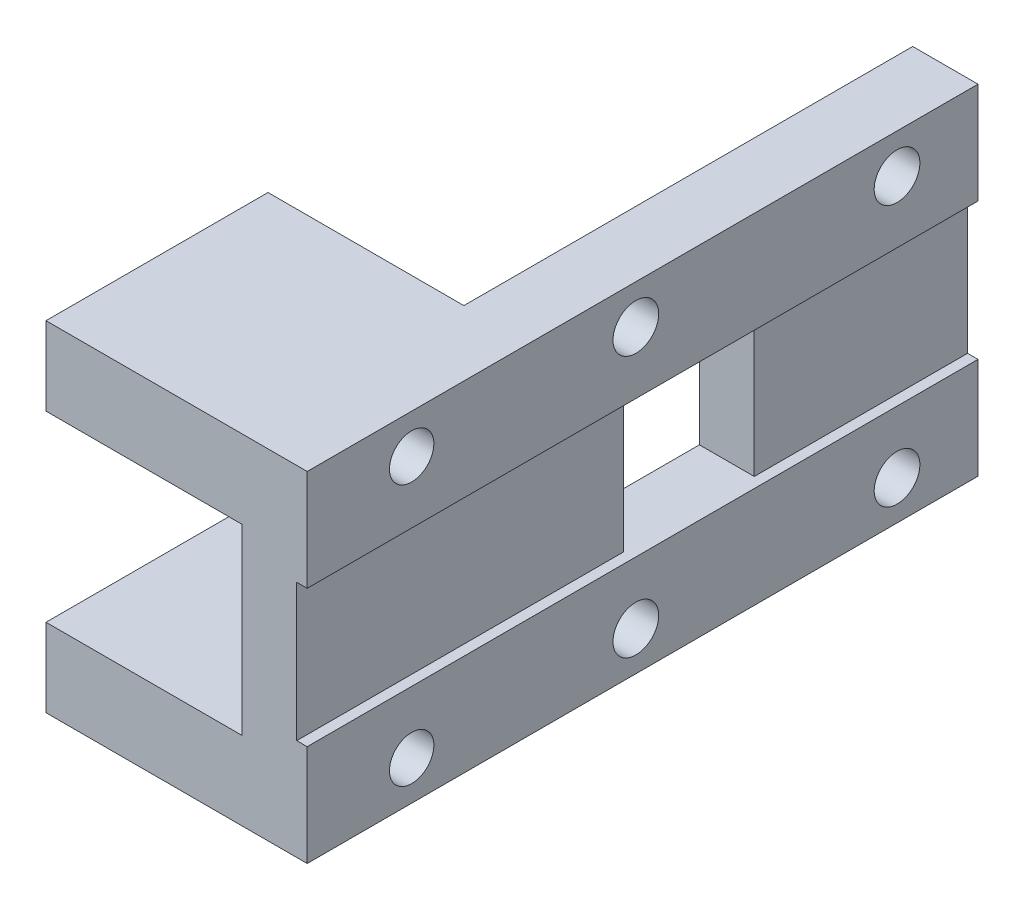
ISO-10303-21;
HEADER;
FILE_DESCRIPTION(('STEP AP214'),'2;1');
FILE_NAME('part.step','',(''),(''),'','','');
FILE_SCHEMA(('AUTOMOTIVE_DESIGN { 1 0 10303 214 1 1 1 1 }'));
ENDSEC;
DATA;
#1=APPLICATION_CONTEXT('core data for automotive mechanical design processes');
#2=APPLICATION_PROTOCOL_DEFINITION('international standard','automotive_design',2000,#1);
#3=PRODUCT_CONTEXT('',#1,'mechanical');
#4=PRODUCT('Part','Part','',(#3));
#5=PRODUCT_RELATED_PRODUCT_CATEGORY('part','',(#4));
#6=PRODUCT_DEFINITION_FORMATION('','',#4);
#7=PRODUCT_DEFINITION_CONTEXT('part definition',#1,'design');
#8=PRODUCT_DEFINITION('design','',#6,#7);
#9=PRODUCT_DEFINITION_SHAPE('','',#8);
#10=(LENGTH_UNIT() NAMED_UNIT(*) SI_UNIT(.MILLI.,.METRE.));
#11=(NAMED_UNIT(*) PLANE_ANGLE_UNIT() SI_UNIT($,.RADIAN.));
#12=(NAMED_UNIT(*) SI_UNIT($,.STERADIAN.) SOLID_ANGLE_UNIT());
#13=UNCERTAINTY_MEASURE_WITH_UNIT(LENGTH_MEASURE(1.E-05),#10,'distance_accuracy_value','');
#14=(GEOMETRIC_REPRESENTATION_CONTEXT(3) GLOBAL_UNCERTAINTY_ASSIGNED_CONTEXT((#13)) GLOBAL_UNIT_ASSIGNED_CONTEXT((#10,
#11,#12)) REPRESENTATION_CONTEXT('',''));
#15=CARTESIAN_POINT('',(0.,0.,0.));
#16=DIRECTION('',(0.,0.,1.));
#17=DIRECTION('',(1.,0.,0.));
#18=AXIS2_PLACEMENT_3D('',#15,#16,#17);
#19=CARTESIAN_POINT('',(136.99996276809,-124.000037425625,-132.46692088768));
#20=DIRECTION('',(0.,-1.,0.));
#21=DIRECTION('',(-1.,0.,0.));
#22=AXIS2_PLACEMENT_3D('',#19,#20,#21);
#23=PLANE('',#22);
#24=DIRECTION('',(0.,0.,1.));
#25=VECTOR('',#24,1.);
#26=CARTESIAN_POINT('',(136.99996276809,-124.000037425625,-132.46692088768));
#27=LINE('',#26,#25);
#28=CARTESIAN_POINT('',(136.99996276809,-124.000037425625,-132.46692088768));
#29=VERTEX_POINT('',#28);
#30=CARTESIAN_POINT('',(136.99996276809,-124.000037425625,-97.3000017784545));
#31=VERTEX_POINT('',#30);
#32=EDGE_CURVE('E295',#29,#31,#27,.T.);
#33=ORIENTED_EDGE('',*,*,#32,.T.);
#34=DIRECTION('',(1.,0.,0.));
#35=VECTOR('',#34,1.);
#36=CARTESIAN_POINT('',(131.99996276809,-124.000037425625,-97.3000017784545));
#37=LINE('',#36,#35);
#38=CARTESIAN_POINT('',(116.99996276809,-124.000037425625,-97.3000017784545));
#39=VERTEX_POINT('',#38);
#40=EDGE_CURVE('E450',#39,#31,#37,.T.);
#41=ORIENTED_EDGE('',*,*,#40,.F.);
#42=DIRECTION('',(0.,0.,1.));
#43=VECTOR('',#42,1.);
#44=CARTESIAN_POINT('',(116.99996276809,-124.000037425625,-114.300001778454));
#45=LINE('',#44,#43);
#46=CARTESIAN_POINT('',(116.99996276809,-124.000037425625,-114.300001778454));
#47=VERTEX_POINT('',#46);
#48=EDGE_CURVE('E369',#47,#39,#45,.T.);
#49=ORIENTED_EDGE('',*,*,#48,.F.);
#50=DIRECTION('',(-1.,0.,0.));
#51=VECTOR('',#50,1.);
#52=CARTESIAN_POINT('',(131.99996276809,-124.000037425625,-114.300001778454));
#53=LINE('',#52,#51);
#54=CARTESIAN_POINT('',(131.99996276809,-124.000037425625,-114.300001778454));
#55=VERTEX_POINT('',#54);
#56=EDGE_CURVE('E340',#55,#47,#53,.T.);
#57=ORIENTED_EDGE('',*,*,#56,.F.);
#58=DIRECTION('',(0.,0.,1.));
#59=VECTOR('',#58,1.);
#60=CARTESIAN_POINT('',(131.99996276809,-124.000037425625,-132.46692088768));
#61=LINE('',#60,#59);
#62=CARTESIAN_POINT('',(131.99996276809,-124.000037425625,-132.46692088768));
#63=VERTEX_POINT('',#62);
#64=EDGE_CURVE('E287',#63,#55,#61,.T.);
#65=ORIENTED_EDGE('',*,*,#64,.F.);
#66=DIRECTION('',(0.,0.,-1.));
#67=VECTOR('',#66,1.);
#68=CARTESIAN_POINT('',(131.99996276809,-124.000037425625,-132.46692088768));
#69=LINE('',#68,#67);
#70=CARTESIAN_POINT('',(131.99996276809,-124.000037425625,-148.66692088768));
#71=VERTEX_POINT('',#70);
#72=EDGE_CURVE('E284',#63,#71,#69,.T.);
#73=ORIENTED_EDGE('',*,*,#72,.T.);
#74=DIRECTION('',(-1.,0.,0.));
#75=VECTOR('',#74,1.);
#76=CARTESIAN_POINT('',(136.99996276809,-124.000037425625,-148.66692088768));
#77=LINE('',#76,#75);
#78=CARTESIAN_POINT('',(136.99996276809,-124.000037425625,-148.66692088768));
#79=VERTEX_POINT('',#78);
#80=EDGE_CURVE('E296',#71,#79,#77,.F.);
#81=ORIENTED_EDGE('',*,*,#80,.T.);
#82=DIRECTION('',(0.,0.,-1.));
#83=VECTOR('',#82,1.);
#84=CARTESIAN_POINT('',(136.99996276809,-124.000037425625,-132.46692088768));
#85=LINE('',#84,#83);
#86=EDGE_CURVE('E292',#79,#29,#85,.F.);
#87=ORIENTED_EDGE('',*,*,#86,.T.);
#88=EDGE_LOOP('',(#33,#41,#49,#57,#65,#73,#81,#87));
#89=FACE_BOUND('',#88,.T.);
#90=ADVANCED_FACE('F16',(#89),#23,.T.);
#91=CARTESIAN_POINT('',(136.99996276809,-98.0000370381948,-106.000001778454));
#92=DIRECTION('',(0.,1.,0.));
#93=DIRECTION('',(1.,0.,0.));
#94=AXIS2_PLACEMENT_3D('',#91,#92,#93);
#95=PLANE('',#94);
#96=DIRECTION('',(0.,0.,1.));
#97=VECTOR('',#96,1.);
#98=CARTESIAN_POINT('',(136.99996276809,-98.0000370381948,-106.000001778454));
#99=LINE('',#98,#97);
#100=CARTESIAN_POINT('',(136.99996276809,-98.0000370381948,-132.46692088768));
#101=VERTEX_POINT('',#100);
#102=CARTESIAN_POINT('',(136.99996276809,-98.0000370381948,-97.3000017784545));
#103=VERTEX_POINT('',#102);
#104=EDGE_CURVE('E240',#101,#103,#99,.T.);
#105=ORIENTED_EDGE('',*,*,#104,.F.);
#106=DIRECTION('',(0.,0.,-1.));
#107=VECTOR('',#106,1.);
#108=CARTESIAN_POINT('',(136.99996276809,-98.0000370381948,-106.000001778454));
#109=LINE('',#108,#107);
#110=CARTESIAN_POINT('',(136.99996276809,-98.0000370381948,-148.66692088768));
#111=VERTEX_POINT('',#110);
#112=EDGE_CURVE('E20',#101,#111,#109,.T.);
#113=ORIENTED_EDGE('',*,*,#112,.T.);
#114=DIRECTION('',(1.,0.,0.));
#115=VECTOR('',#114,1.);
#116=CARTESIAN_POINT('',(136.99996276809,-98.0000370381948,-148.66692088768));
#117=LINE('',#116,#115);
#118=CARTESIAN_POINT('',(131.99996276809,-98.0000370381948,-148.66692088768));
#119=VERTEX_POINT('',#118);
#120=EDGE_CURVE('E248',#111,#119,#117,.F.);
#121=ORIENTED_EDGE('',*,*,#120,.T.);
#122=DIRECTION('',(0.,0.,-1.));
#123=VECTOR('',#122,1.);
#124=CARTESIAN_POINT('',(131.99996276809,-98.0000370381948,-106.000001778454));
#125=LINE('',#124,#123);
#126=CARTESIAN_POINT('',(131.99996276809,-98.0000370381948,-132.46692088768));
#127=VERTEX_POINT('',#126);
#128=EDGE_CURVE('E288',#119,#127,#125,.F.);
#129=ORIENTED_EDGE('',*,*,#128,.T.);
#130=DIRECTION('',(0.,0.,1.));
#131=VECTOR('',#130,1.);
#132=CARTESIAN_POINT('',(131.99996276809,-98.0000370381948,-106.000001778454));
#133=LINE('',#132,#131);
#134=CARTESIAN_POINT('',(131.99996276809,-98.0000370381948,-114.300001778454));
#135=VERTEX_POINT('',#134);
#136=EDGE_CURVE('E291',#127,#135,#133,.T.);
#137=ORIENTED_EDGE('',*,*,#136,.T.);
#138=DIRECTION('',(-1.,0.,0.));
#139=VECTOR('',#138,1.);
#140=CARTESIAN_POINT('',(131.99996276809,-98.0000370381948,-114.300001778454));
#141=LINE('',#140,#139);
#142=CARTESIAN_POINT('',(116.99996276809,-98.0000370381948,-114.300001778454));
#143=VERTEX_POINT('',#142);
#144=EDGE_CURVE('E372',#135,#143,#141,.T.);
#145=ORIENTED_EDGE('',*,*,#144,.T.);
#146=DIRECTION('',(0.,0.,1.));
#147=VECTOR('',#146,1.);
#148=CARTESIAN_POINT('',(116.99996276809,-98.0000370381948,-102.300001778455));
#149=LINE('',#148,#147);
#150=CARTESIAN_POINT('',(116.99996276809,-98.0000370381948,-97.3000017784545));
#151=VERTEX_POINT('',#150);
#152=EDGE_CURVE('E395',#143,#151,#149,.T.);
#153=ORIENTED_EDGE('',*,*,#152,.T.);
#154=DIRECTION('',(-1.,0.,0.));
#155=VECTOR('',#154,1.);
#156=CARTESIAN_POINT('',(136.99996276809,-98.0000370381948,-97.3000017784545));
#157=LINE('',#156,#155);
#158=EDGE_CURVE('E326',#103,#151,#157,.T.);
#159=ORIENTED_EDGE('',*,*,#158,.F.);
#160=EDGE_LOOP('',(#105,#113,#121,#129,#137,#145,#153,#159));
#161=FACE_BOUND('',#160,.T.);
#162=ADVANCED_FACE('F260',(#161),#95,.T.);
#163=CARTESIAN_POINT('',(136.99996276809,-101.00003723191,-122.46692088768));
#164=DIRECTION('',(-1.,0.,0.));
#165=DIRECTION('',(0.,-1.,0.));
#166=AXIS2_PLACEMENT_3D('',#163,#164,#165);
#167=CYLINDRICAL_SURFACE('',#166,1.75);
#168=CARTESIAN_POINT('',(131.99996276809,-101.00003723191,-122.46692088768));
#169=DIRECTION('',(1.,0.,0.));
#170=DIRECTION('',(0.,-1.,0.));
#171=AXIS2_PLACEMENT_3D('',#168,#169,#170);
#172=CIRCLE('',#171,1.75);
#173=CARTESIAN_POINT('',(131.99996276809,-99.25003723191,-122.46692088768));
#174=VERTEX_POINT('',#173);
#175=EDGE_CURVE('E380',#174,#174,#172,.T.);
#176=ORIENTED_EDGE('',*,*,#175,.F.);
#177=DIRECTION('',(1.,0.,0.));
#178=VECTOR('',#177,1.);
#179=CARTESIAN_POINT('',(136.99996276809,-99.25003723191,-122.46692088768));
#180=LINE('',#179,#178);
#181=CARTESIAN_POINT('',(136.99996276809,-99.25003723191,-122.46692088768));
#182=VERTEX_POINT('',#181);
#183=EDGE_CURVE('E11',#174,#182,#180,.T.);
#184=ORIENTED_EDGE('',*,*,#183,.T.);
#185=CARTESIAN_POINT('',(136.99996276809,-101.00003723191,-122.46692088768));
#186=DIRECTION('',(1.,0.,0.));
#187=DIRECTION('',(0.,-1.,0.));
#188=AXIS2_PLACEMENT_3D('',#185,#186,#187);
#189=CIRCLE('',#188,1.75);
#190=EDGE_CURVE('E283',#182,#182,#189,.T.);
#191=ORIENTED_EDGE('',*,*,#190,.T.);
#192=ORIENTED_EDGE('',*,*,#183,.F.);
#193=EDGE_LOOP('',(#176,#184,#191,#192));
#194=FACE_BOUND('',#193,.T.);
#195=ADVANCED_FACE('F18',(#194),#167,.F.);
#196=CARTESIAN_POINT('',(136.99996276809,-121.00003723191,-142.46692088768));
#197=DIRECTION('',(-1.,0.,0.));
#198=DIRECTION('',(0.,-1.,0.));
#199=AXIS2_PLACEMENT_3D('',#196,#197,#198);
#200=CYLINDRICAL_SURFACE('',#199,1.75);
#201=CARTESIAN_POINT('',(131.99996276809,-121.00003723191,-142.46692088768));
#202=DIRECTION('',(1.,0.,0.));
#203=DIRECTION('',(0.,-1.,0.));
#204=AXIS2_PLACEMENT_3D('',#201,#202,#203);
#205=CIRCLE('',#204,1.75);
#206=CARTESIAN_POINT('',(131.99996276809,-119.25003723191,-142.46692088768));
#207=VERTEX_POINT('',#206);
#208=EDGE_CURVE('E375',#207,#207,#205,.T.);
#209=ORIENTED_EDGE('',*,*,#208,.F.);
#210=DIRECTION('',(1.,0.,0.));
#211=VECTOR('',#210,1.);
#212=CARTESIAN_POINT('',(136.99996276809,-119.25003723191,-142.46692088768));
#213=LINE('',#212,#211);
#214=CARTESIAN_POINT('',(136.99996276809,-119.25003723191,-142.46692088768));
#215=VERTEX_POINT('',#214);
#216=EDGE_CURVE('E27',#207,#215,#213,.T.);
#217=ORIENTED_EDGE('',*,*,#216,.T.);
#218=CARTESIAN_POINT('',(136.99996276809,-121.00003723191,-142.46692088768));
#219=DIRECTION('',(1.,0.,0.));
#220=DIRECTION('',(0.,-1.,0.));
#221=AXIS2_PLACEMENT_3D('',#218,#219,#220);
#222=CIRCLE('',#221,1.75);
#223=EDGE_CURVE('E415',#215,#215,#222,.T.);
#224=ORIENTED_EDGE('',*,*,#223,.T.);
#225=ORIENTED_EDGE('',*,*,#216,.F.);
#226=EDGE_LOOP('',(#209,#217,#224,#225));
#227=FACE_BOUND('',#226,.T.);
#228=ADVANCED_FACE('F689',(#227),#200,.F.);
#229=CARTESIAN_POINT('',(136.99996276809,-121.00003723191,-122.46692088768));
#230=DIRECTION('',(-1.,0.,0.));
#231=DIRECTION('',(0.,-1.,0.));
#232=AXIS2_PLACEMENT_3D('',#229,#230,#231);
#233=CYLINDRICAL_SURFACE('',#232,1.75);
#234=CARTESIAN_POINT('',(131.99996276809,-121.00003723191,-122.46692088768));
#235=DIRECTION('',(1.,0.,0.));
#236=DIRECTION('',(0.,-1.,0.));
#237=AXIS2_PLACEMENT_3D('',#234,#235,#236);
#238=CIRCLE('',#237,1.75);
#239=CARTESIAN_POINT('',(131.99996276809,-119.25003723191,-122.46692088768));
#240=VERTEX_POINT('',#239);
#241=EDGE_CURVE('E379',#240,#240,#238,.T.);
#242=ORIENTED_EDGE('',*,*,#241,.F.);
#243=DIRECTION('',(1.,0.,0.));
#244=VECTOR('',#243,1.);
#245=CARTESIAN_POINT('',(136.99996276809,-119.25003723191,-122.46692088768));
#246=LINE('',#245,#244);
#247=CARTESIAN_POINT('',(136.99996276809,-119.25003723191,-122.46692088768));
#248=VERTEX_POINT('',#247);
#249=EDGE_CURVE('E418',#240,#248,#246,.T.);
#250=ORIENTED_EDGE('',*,*,#249,.T.);
#251=CARTESIAN_POINT('',(136.99996276809,-121.00003723191,-122.46692088768));
#252=DIRECTION('',(1.,0.,0.));
#253=DIRECTION('',(0.,-1.,0.));
#254=AXIS2_PLACEMENT_3D('',#251,#252,#253);
#255=CIRCLE('',#254,1.75);
#256=EDGE_CURVE('E294',#248,#248,#255,.T.);
#257=ORIENTED_EDGE('',*,*,#256,.T.);
#258=ORIENTED_EDGE('',*,*,#249,.F.);
#259=EDGE_LOOP('',(#242,#250,#257,#258));
#260=FACE_BOUND('',#259,.T.);
#261=ADVANCED_FACE('F694',(#260),#233,.F.);
#262=CARTESIAN_POINT('',(136.99996276809,-101.00003723191,-142.46692088768));
#263=DIRECTION('',(-1.,0.,0.));
#264=DIRECTION('',(0.,-1.,0.));
#265=AXIS2_PLACEMENT_3D('',#262,#263,#264);
#266=CYLINDRICAL_SURFACE('',#265,1.75);
#267=CARTESIAN_POINT('',(131.99996276809,-101.00003723191,-142.46692088768));
#268=DIRECTION('',(1.,0.,0.));
#269=DIRECTION('',(0.,-1.,0.));
#270=AXIS2_PLACEMENT_3D('',#267,#268,#269);
#271=CIRCLE('',#270,1.75);
#272=CARTESIAN_POINT('',(131.99996276809,-99.25003723191,-142.46692088768));
#273=VERTEX_POINT('',#272);
#274=EDGE_CURVE('E405',#273,#273,#271,.T.);
#275=ORIENTED_EDGE('',*,*,#274,.F.);
#276=DIRECTION('',(1.,0.,0.));
#277=VECTOR('',#276,1.);
#278=CARTESIAN_POINT('',(136.99996276809,-99.25003723191,-142.46692088768));
#279=LINE('',#278,#277);
#280=CARTESIAN_POINT('',(136.99996276809,-99.25003723191,-142.46692088768));
#281=VERTEX_POINT('',#280);
#282=EDGE_CURVE('E41',#273,#281,#279,.T.);
#283=ORIENTED_EDGE('',*,*,#282,.T.);
#284=CARTESIAN_POINT('',(136.99996276809,-101.00003723191,-142.46692088768));
#285=DIRECTION('',(1.,0.,0.));
#286=DIRECTION('',(0.,-1.,0.));
#287=AXIS2_PLACEMENT_3D('',#284,#285,#286);
#288=CIRCLE('',#287,1.75);
#289=EDGE_CURVE('E411',#281,#281,#288,.T.);
#290=ORIENTED_EDGE('',*,*,#289,.T.);
#291=ORIENTED_EDGE('',*,*,#282,.F.);
#292=EDGE_LOOP('',(#275,#283,#290,#291));
#293=FACE_BOUND('',#292,.T.);
#294=ADVANCED_FACE('F718',(#293),#266,.F.);
#295=CARTESIAN_POINT('',(136.19996276809,-111.00003723191,-127.333461333067));
#296=DIRECTION('',(-1.,0.,0.));
#297=DIRECTION('',(0.,0.,1.));
#298=AXIS2_PLACEMENT_3D('',#295,#296,#297);
#299=PLANE('',#298);
#300=DIRECTION('',(0.,-1.,0.));
#301=VECTOR('',#300,1.);
#302=CARTESIAN_POINT('',(136.19996276809,-108.47503723191,-132.333461333067));
#303=LINE('',#302,#301);
#304=CARTESIAN_POINT('',(136.19996276809,-105.75003723191,-132.333461333067));
#305=VERTEX_POINT('',#304);
#306=CARTESIAN_POINT('',(136.19996276809,-116.25003723191,-132.333461333067));
#307=VERTEX_POINT('',#306);
#308=EDGE_CURVE('E401',#305,#307,#303,.T.);
#309=ORIENTED_EDGE('',*,*,#308,.T.);
#310=DIRECTION('',(0.,0.,-1.));
#311=VECTOR('',#310,1.);
#312=CARTESIAN_POINT('',(136.19996276809,-116.25003723191,-148.66692088768));
#313=LINE('',#312,#311);
#314=CARTESIAN_POINT('',(136.19996276809,-116.25003723191,-148.66692088768));
#315=VERTEX_POINT('',#314);
#316=EDGE_CURVE('E351',#307,#315,#313,.T.);
#317=ORIENTED_EDGE('',*,*,#316,.T.);
#318=DIRECTION('',(0.,-1.,0.));
#319=VECTOR('',#318,1.);
#320=CARTESIAN_POINT('',(136.19996276809,-108.525046394351,-148.66692088768));
#321=LINE('',#320,#319);
#322=CARTESIAN_POINT('',(136.19996276809,-105.75003723191,-148.66692088768));
#323=VERTEX_POINT('',#322);
#324=EDGE_CURVE('E313',#323,#315,#321,.T.);
#325=ORIENTED_EDGE('',*,*,#324,.F.);
#326=DIRECTION('',(0.,0.,1.));
#327=VECTOR('',#326,1.);
#328=CARTESIAN_POINT('',(136.19996276809,-105.75003723191,-106.000001778454));
#329=LINE('',#328,#327);
#330=EDGE_CURVE('E324',#323,#305,#329,.T.);
#331=ORIENTED_EDGE('',*,*,#330,.T.);
#332=EDGE_LOOP('',(#309,#317,#325,#331));
#333=FACE_BOUND('',#332,.T.);
#334=ADVANCED_FACE('F568',(#333),#299,.F.);
#335=CARTESIAN_POINT('',(136.19996276809,-111.00003723191,-127.333461333067));
#336=DIRECTION('',(-1.,0.,0.));
#337=DIRECTION('',(0.,0.,1.));
#338=AXIS2_PLACEMENT_3D('',#335,#336,#337);
#339=PLANE('',#338);
#340=DIRECTION('',(0.,1.,0.));
#341=VECTOR('',#340,1.);
#342=CARTESIAN_POINT('',(136.19996276809,-113.52503723191,-122.333461333067));
#343=LINE('',#342,#341);
#344=CARTESIAN_POINT('',(136.19996276809,-116.25003723191,-122.333461333067));
#345=VERTEX_POINT('',#344);
#346=CARTESIAN_POINT('',(136.19996276809,-105.75003723191,-122.333461333067));
#347=VERTEX_POINT('',#346);
#348=EDGE_CURVE('E404',#345,#347,#343,.T.);
#349=ORIENTED_EDGE('',*,*,#348,.T.);
#350=DIRECTION('',(0.,0.,1.));
#351=VECTOR('',#350,1.);
#352=CARTESIAN_POINT('',(136.19996276809,-105.75003723191,-106.000001778454));
#353=LINE('',#352,#351);
#354=CARTESIAN_POINT('',(136.19996276809,-105.75003723191,-97.3000017784545));
#355=VERTEX_POINT('',#354);
#356=EDGE_CURVE('E427',#347,#355,#353,.T.);
#357=ORIENTED_EDGE('',*,*,#356,.T.);
#358=DIRECTION('',(0.,1.,0.));
#359=VECTOR('',#358,1.);
#360=CARTESIAN_POINT('',(136.19996276809,-120.025037328767,-97.3000017784545));
#361=LINE('',#360,#359);
#362=CARTESIAN_POINT('',(136.19996276809,-116.25003723191,-97.3000017784545));
#363=VERTEX_POINT('',#362);
#364=EDGE_CURVE('E352',#363,#355,#361,.T.);
#365=ORIENTED_EDGE('',*,*,#364,.F.);
#366=DIRECTION('',(0.,0.,-1.));
#367=VECTOR('',#366,1.);
#368=CARTESIAN_POINT('',(136.19996276809,-116.25003723191,-106.000001778454));
#369=LINE('',#368,#367);
#370=EDGE_CURVE('E423',#363,#345,#369,.T.);
#371=ORIENTED_EDGE('',*,*,#370,.T.);
#372=EDGE_LOOP('',(#349,#357,#365,#371));
#373=FACE_BOUND('',#372,.T.);
#374=ADVANCED_FACE('F583',(#373),#339,.F.);
#375=CARTESIAN_POINT('',(136.19996276809,-116.05003723191,-122.333461333067));
#376=DIRECTION('',(0.,0.,1.));
#377=DIRECTION('',(1.,0.,0.));
#378=AXIS2_PLACEMENT_3D('',#375,#376,#377);
#379=PLANE('',#378);
#380=DIRECTION('',(0.,-1.,0.));
#381=VECTOR('',#380,1.);
#382=CARTESIAN_POINT('',(131.99996276809,-113.52503723191,-122.333461333067));
#383=LINE('',#382,#381);
#384=CARTESIAN_POINT('',(131.99996276809,-105.75003723191,-122.333461333067));
#385=VERTEX_POINT('',#384);
#386=CARTESIAN_POINT('',(131.99996276809,-116.25003723191,-122.333461333067));
#387=VERTEX_POINT('',#386);
#388=EDGE_CURVE('E342',#385,#387,#383,.T.);
#389=ORIENTED_EDGE('',*,*,#388,.F.);
#390=DIRECTION('',(1.,0.,0.));
#391=VECTOR('',#390,1.);
#392=CARTESIAN_POINT('',(136.19996276809,-105.75003723191,-122.333461333067));
#393=LINE('',#392,#391);
#394=EDGE_CURVE('E431',#385,#347,#393,.T.);
#395=ORIENTED_EDGE('',*,*,#394,.T.);
#396=ORIENTED_EDGE('',*,*,#348,.F.);
#397=DIRECTION('',(-1.,0.,0.));
#398=VECTOR('',#397,1.);
#399=CARTESIAN_POINT('',(136.19996276809,-116.25003723191,-122.333461333067));
#400=LINE('',#399,#398);
#401=EDGE_CURVE('E419',#345,#387,#400,.T.);
#402=ORIENTED_EDGE('',*,*,#401,.T.);
#403=EDGE_LOOP('',(#389,#395,#396,#402));
#404=FACE_BOUND('',#403,.T.);
#405=ADVANCED_FACE('F707',(#404),#379,.F.);
#406=CARTESIAN_POINT('',(136.19996276809,-105.95003723191,-132.333461333067));
#407=DIRECTION('',(0.,0.,-1.));
#408=DIRECTION('',(0.,-1.,0.));
#409=AXIS2_PLACEMENT_3D('',#406,#407,#408);
#410=PLANE('',#409);
#411=DIRECTION('',(0.,1.,0.));
#412=VECTOR('',#411,1.);
#413=CARTESIAN_POINT('',(131.99996276809,-113.52503723191,-132.333461333067));
#414=LINE('',#413,#412);
#415=CARTESIAN_POINT('',(131.99996276809,-116.25003723191,-132.333461333067));
#416=VERTEX_POINT('',#415);
#417=CARTESIAN_POINT('',(131.99996276809,-105.75003723191,-132.333461333067));
#418=VERTEX_POINT('',#417);
#419=EDGE_CURVE('E345',#416,#418,#414,.T.);
#420=ORIENTED_EDGE('',*,*,#419,.F.);
#421=DIRECTION('',(1.,0.,0.));
#422=VECTOR('',#421,1.);
#423=CARTESIAN_POINT('',(136.19996276809,-116.25003723191,-132.333461333067));
#424=LINE('',#423,#422);
#425=EDGE_CURVE('E346',#416,#307,#424,.T.);
#426=ORIENTED_EDGE('',*,*,#425,.T.);
#427=ORIENTED_EDGE('',*,*,#308,.F.);
#428=DIRECTION('',(-1.,0.,0.));
#429=VECTOR('',#428,1.);
#430=CARTESIAN_POINT('',(136.19996276809,-105.75003723191,-132.333461333067));
#431=LINE('',#430,#429);
#432=EDGE_CURVE('E456',#305,#418,#431,.T.);
#433=ORIENTED_EDGE('',*,*,#432,.T.);
#434=EDGE_LOOP('',(#420,#426,#427,#433));
#435=FACE_BOUND('',#434,.T.);
#436=ADVANCED_FACE('F574',(#435),#410,.F.);
#437=CARTESIAN_POINT('',(131.99996276809,-111.00003723191,-127.333461333067));
#438=DIRECTION('',(-1.,0.,0.));
#439=DIRECTION('',(0.,1.,0.));
#440=AXIS2_PLACEMENT_3D('',#437,#438,#439);
#441=PLANE('',#440);
#442=ORIENTED_EDGE('',*,*,#274,.T.);
#443=EDGE_LOOP('',(#442));
#444=FACE_BOUND('',#443,.T.);
#445=ORIENTED_EDGE('',*,*,#241,.T.);
#446=EDGE_LOOP('',(#445));
#447=FACE_BOUND('',#446,.T.);
#448=ORIENTED_EDGE('',*,*,#208,.T.);
#449=EDGE_LOOP('',(#448));
#450=FACE_BOUND('',#449,.T.);
#451=ORIENTED_EDGE('',*,*,#175,.T.);
#452=EDGE_LOOP('',(#451));
#453=FACE_BOUND('',#452,.T.);
#454=ORIENTED_EDGE('',*,*,#388,.T.);
#455=DIRECTION('',(0.,0.,-1.));
#456=VECTOR('',#455,1.);
#457=CARTESIAN_POINT('',(131.99996276809,-116.25003723191,-138.000191110373));
#458=LINE('',#457,#456);
#459=EDGE_CURVE('E350',#387,#416,#458,.T.);
#460=ORIENTED_EDGE('',*,*,#459,.T.);
#461=ORIENTED_EDGE('',*,*,#419,.T.);
#462=DIRECTION('',(0.,0.,1.));
#463=VECTOR('',#462,1.);
#464=CARTESIAN_POINT('',(131.99996276809,-105.75003723191,-116.666731555761));
#465=LINE('',#464,#463);
#466=EDGE_CURVE('E439',#418,#385,#465,.T.);
#467=ORIENTED_EDGE('',*,*,#466,.T.);
#468=EDGE_LOOP('',(#454,#460,#461,#467));
#469=FACE_BOUND('',#468,.T.);
#470=DIRECTION('',(0.,0.,1.));
#471=VECTOR('',#470,1.);
#472=CARTESIAN_POINT('',(131.99996276809,-118.000037425625,-114.816731555761));
#473=LINE('',#472,#471);
#474=CARTESIAN_POINT('',(131.99996276809,-118.000037425625,-114.300001778454));
#475=VERTEX_POINT('',#474);
#476=CARTESIAN_POINT('',(131.99996276809,-118.000037425625,-97.3000017784545));
#477=VERTEX_POINT('',#476);
#478=EDGE_CURVE('E466',#475,#477,#473,.T.);
#479=ORIENTED_EDGE('',*,*,#478,.T.);
#480=DIRECTION('',(0.,-1.,0.));
#481=VECTOR('',#480,1.);
#482=CARTESIAN_POINT('',(131.99996276809,-124.000037425625,-97.3000017784545));
#483=LINE('',#482,#481);
#484=CARTESIAN_POINT('',(131.99996276809,-104.000037127602,-97.3000017784545));
#485=VERTEX_POINT('',#484);
#486=EDGE_CURVE('E384',#485,#477,#483,.T.);
#487=ORIENTED_EDGE('',*,*,#486,.F.);
#488=DIRECTION('',(0.,0.,-1.));
#489=VECTOR('',#488,1.);
#490=CARTESIAN_POINT('',(131.99996276809,-104.000037127602,-120.816731555761));
#491=LINE('',#490,#489);
#492=CARTESIAN_POINT('',(131.99996276809,-104.000037127602,-114.300001778454));
#493=VERTEX_POINT('',#492);
#494=EDGE_CURVE('E364',#485,#493,#491,.T.);
#495=ORIENTED_EDGE('',*,*,#494,.T.);
#496=DIRECTION('',(0.,1.,0.));
#497=VECTOR('',#496,1.);
#498=CARTESIAN_POINT('',(131.99996276809,-104.500037135052,-114.300001778454));
#499=LINE('',#498,#497);
#500=EDGE_CURVE('E373',#493,#135,#499,.T.);
#501=ORIENTED_EDGE('',*,*,#500,.T.);
#502=ORIENTED_EDGE('',*,*,#136,.F.);
#503=ORIENTED_EDGE('',*,*,#128,.F.);
#504=DIRECTION('',(0.,1.,0.));
#505=VECTOR('',#504,1.);
#506=CARTESIAN_POINT('',(131.99996276809,-98.1000555567923,-148.66692088768));
#507=LINE('',#506,#505);
#508=EDGE_CURVE('E256',#71,#119,#507,.T.);
#509=ORIENTED_EDGE('',*,*,#508,.F.);
#510=ORIENTED_EDGE('',*,*,#72,.F.);
#511=ORIENTED_EDGE('',*,*,#64,.T.);
#512=DIRECTION('',(0.,1.,0.));
#513=VECTOR('',#512,1.);
#514=CARTESIAN_POINT('',(131.99996276809,-114.500037328767,-114.300001778454));
#515=LINE('',#514,#513);
#516=EDGE_CURVE('E336',#55,#475,#515,.T.);
#517=ORIENTED_EDGE('',*,*,#516,.T.);
#518=EDGE_LOOP('',(#479,#487,#495,#501,#502,#503,#509,#510,#511,#517));
#519=FACE_BOUND('',#518,.T.);
#520=ADVANCED_FACE('F773',(#444,#447,#450,#453,#469,#519),#441,.T.);
#521=CARTESIAN_POINT('',(116.99996276809,-101.000037082898,-108.300001778455));
#522=DIRECTION('',(-1.,0.,0.));
#523=DIRECTION('',(0.,0.,1.));
#524=AXIS2_PLACEMENT_3D('',#521,#522,#523);
#525=PLANE('',#524);
#526=CARTESIAN_POINT('',(116.99996276809,-101.000037082898,-105.300001778455));
#527=DIRECTION('',(1.,0.,0.));
#528=DIRECTION('',(0.,-1.,0.));
#529=AXIS2_PLACEMENT_3D('',#526,#527,#528);
#530=CIRCLE('',#529,1.7);
#531=CARTESIAN_POINT('',(116.99996276809,-99.3000370828983,-105.300001778455));
#532=VERTEX_POINT('',#531);
#533=EDGE_CURVE('E469',#532,#532,#530,.T.);
#534=ORIENTED_EDGE('',*,*,#533,.T.);
#535=EDGE_LOOP('',(#534));
#536=FACE_BOUND('',#535,.T.);
#537=DIRECTION('',(0.,-1.,0.));
#538=VECTOR('',#537,1.);
#539=CARTESIAN_POINT('',(116.99996276809,-104.000037127602,-114.300001778454));
#540=LINE('',#539,#538);
#541=CARTESIAN_POINT('',(116.99996276809,-104.000037127602,-114.300001778454));
#542=VERTEX_POINT('',#541);
#543=EDGE_CURVE('E370',#143,#542,#540,.T.);
#544=ORIENTED_EDGE('',*,*,#543,.T.);
#545=DIRECTION('',(0.,0.,1.));
#546=VECTOR('',#545,1.);
#547=CARTESIAN_POINT('',(116.99996276809,-104.000037127602,-102.300001778455));
#548=LINE('',#547,#546);
#549=CARTESIAN_POINT('',(116.99996276809,-104.000037127602,-97.3000017784545));
#550=VERTEX_POINT('',#549);
#551=EDGE_CURVE('E368',#542,#550,#548,.T.);
#552=ORIENTED_EDGE('',*,*,#551,.T.);
#553=DIRECTION('',(0.,-1.,0.));
#554=VECTOR('',#553,1.);
#555=CARTESIAN_POINT('',(116.99996276809,-98.0000370381948,-97.3000017784545));
#556=LINE('',#555,#554);
#557=EDGE_CURVE('E330',#151,#550,#556,.T.);
#558=ORIENTED_EDGE('',*,*,#557,.F.);
#559=ORIENTED_EDGE('',*,*,#152,.F.);
#560=EDGE_LOOP('',(#544,#552,#558,#559));
#561=FACE_BOUND('',#560,.T.);
#562=ADVANCED_FACE('F515',(#536,#561),#525,.T.);
#563=CARTESIAN_POINT('',(131.99996276809,-98.0000370381948,-114.300001778454));
#564=DIRECTION('',(0.,0.,-1.));
#565=DIRECTION('',(0.,-1.,0.));
#566=AXIS2_PLACEMENT_3D('',#563,#564,#565);
#567=PLANE('',#566);
#568=ORIENTED_EDGE('',*,*,#500,.F.);
#569=DIRECTION('',(-1.,0.,0.));
#570=VECTOR('',#569,1.);
#571=CARTESIAN_POINT('',(131.99996276809,-104.000037127602,-114.300001778454));
#572=LINE('',#571,#570);
#573=EDGE_CURVE('E440',#493,#542,#572,.T.);
#574=ORIENTED_EDGE('',*,*,#573,.T.);
#575=ORIENTED_EDGE('',*,*,#543,.F.);
#576=ORIENTED_EDGE('',*,*,#144,.F.);
#577=EDGE_LOOP('',(#568,#574,#575,#576));
#578=FACE_BOUND('',#577,.T.);
#579=ADVANCED_FACE('F511',(#578),#567,.T.);
#580=CARTESIAN_POINT('',(131.99996276809,-104.000037127602,-114.300001778454));
#581=DIRECTION('',(0.,-1.,0.));
#582=DIRECTION('',(-1.,0.,0.));
#583=AXIS2_PLACEMENT_3D('',#580,#581,#582);
#584=PLANE('',#583);
#585=ORIENTED_EDGE('',*,*,#494,.F.);
#586=DIRECTION('',(1.,0.,0.));
#587=VECTOR('',#586,1.);
#588=CARTESIAN_POINT('',(131.99996276809,-104.000037127602,-97.3000017784545));
#589=LINE('',#588,#587);
#590=EDGE_CURVE('E335',#550,#485,#589,.T.);
#591=ORIENTED_EDGE('',*,*,#590,.F.);
#592=ORIENTED_EDGE('',*,*,#551,.F.);
#593=ORIENTED_EDGE('',*,*,#573,.F.);
#594=EDGE_LOOP('',(#585,#591,#592,#593));
#595=FACE_BOUND('',#594,.T.);
#596=ADVANCED_FACE('F680',(#595),#584,.T.);
#597=CARTESIAN_POINT('',(116.99996276809,-121.000037425625,-108.300001778455));
#598=DIRECTION('',(-1.,0.,0.));
#599=DIRECTION('',(0.,0.,1.));
#600=AXIS2_PLACEMENT_3D('',#597,#598,#599);
#601=PLANE('',#600);
#602=CARTESIAN_POINT('',(116.99996276809,-121.000037425625,-105.300001778455));
#603=DIRECTION('',(1.,0.,0.));
#604=DIRECTION('',(0.,-1.,0.));
#605=AXIS2_PLACEMENT_3D('',#602,#603,#604);
#606=CIRCLE('',#605,1.7);
#607=CARTESIAN_POINT('',(116.99996276809,-119.300037425625,-105.300001778455));
#608=VERTEX_POINT('',#607);
#609=EDGE_CURVE('E356',#608,#608,#606,.T.);
#610=ORIENTED_EDGE('',*,*,#609,.T.);
#611=EDGE_LOOP('',(#610));
#612=FACE_BOUND('',#611,.T.);
#613=ORIENTED_EDGE('',*,*,#48,.T.);
#614=DIRECTION('',(0.,-1.,0.));
#615=VECTOR('',#614,1.);
#616=CARTESIAN_POINT('',(116.99996276809,-124.000037425625,-97.3000017784545));
#617=LINE('',#616,#615);
#618=CARTESIAN_POINT('',(116.99996276809,-118.000037425625,-97.3000017784545));
#619=VERTEX_POINT('',#618);
#620=EDGE_CURVE('E389',#619,#39,#617,.T.);
#621=ORIENTED_EDGE('',*,*,#620,.F.);
#622=DIRECTION('',(0.,0.,1.));
#623=VECTOR('',#622,1.);
#624=CARTESIAN_POINT('',(116.99996276809,-118.000037425625,-102.300001778455));
#625=LINE('',#624,#623);
#626=CARTESIAN_POINT('',(116.99996276809,-118.000037425625,-114.300001778454));
#627=VERTEX_POINT('',#626);
#628=EDGE_CURVE('E463',#627,#619,#625,.T.);
#629=ORIENTED_EDGE('',*,*,#628,.F.);
#630=DIRECTION('',(0.,-1.,0.));
#631=VECTOR('',#630,1.);
#632=CARTESIAN_POINT('',(116.99996276809,-118.000037425625,-114.300001778454));
#633=LINE('',#632,#631);
#634=EDGE_CURVE('E390',#627,#47,#633,.T.);
#635=ORIENTED_EDGE('',*,*,#634,.T.);
#636=EDGE_LOOP('',(#613,#621,#629,#635));
#637=FACE_BOUND('',#636,.T.);
#638=ADVANCED_FACE('F674',(#612,#637),#601,.T.);
#639=CARTESIAN_POINT('',(131.99996276809,-118.000037425625,-102.300001778455));
#640=DIRECTION('',(0.,1.,0.));
#641=DIRECTION('',(1.,0.,0.));
#642=AXIS2_PLACEMENT_3D('',#639,#640,#641);
#643=PLANE('',#642);
#644=ORIENTED_EDGE('',*,*,#478,.F.);
#645=DIRECTION('',(-1.,0.,0.));
#646=VECTOR('',#645,1.);
#647=CARTESIAN_POINT('',(131.99996276809,-118.000037425625,-114.300001778454));
#648=LINE('',#647,#646);
#649=EDGE_CURVE('E394',#475,#627,#648,.T.);
#650=ORIENTED_EDGE('',*,*,#649,.T.);
#651=ORIENTED_EDGE('',*,*,#628,.T.);
#652=DIRECTION('',(-1.,0.,0.));
#653=VECTOR('',#652,1.);
#654=CARTESIAN_POINT('',(131.99996276809,-118.000037425625,-97.3000017784545));
#655=LINE('',#654,#653);
#656=EDGE_CURVE('E385',#477,#619,#655,.T.);
#657=ORIENTED_EDGE('',*,*,#656,.F.);
#658=EDGE_LOOP('',(#644,#650,#651,#657));
#659=FACE_BOUND('',#658,.T.);
#660=ADVANCED_FACE('F679',(#659),#643,.T.);
#661=CARTESIAN_POINT('',(131.99996276809,-118.000037425625,-114.300001778454));
#662=DIRECTION('',(0.,0.,-1.));
#663=DIRECTION('',(0.,-1.,0.));
#664=AXIS2_PLACEMENT_3D('',#661,#662,#663);
#665=PLANE('',#664);
#666=ORIENTED_EDGE('',*,*,#516,.F.);
#667=ORIENTED_EDGE('',*,*,#56,.T.);
#668=ORIENTED_EDGE('',*,*,#634,.F.);
#669=ORIENTED_EDGE('',*,*,#649,.F.);
#670=EDGE_LOOP('',(#666,#667,#668,#669));
#671=FACE_BOUND('',#670,.T.);
#672=ADVANCED_FACE('F664',(#671),#665,.T.);
#673=CARTESIAN_POINT('',(116.99996276809,-101.000037082898,-105.300001778455));
#674=DIRECTION('',(1.,0.,0.));
#675=DIRECTION('',(0.,-1.,0.));
#676=AXIS2_PLACEMENT_3D('',#673,#674,#675);
#677=CYLINDRICAL_SURFACE('',#676,1.7);
#678=ORIENTED_EDGE('',*,*,#533,.F.);
#679=DIRECTION('',(1.,0.,0.));
#680=VECTOR('',#679,1.);
#681=CARTESIAN_POINT('',(116.99996276809,-99.3000370828983,-105.300001778455));
#682=LINE('',#681,#680);
#683=CARTESIAN_POINT('',(136.99996276809,-99.3000370828983,-105.300001778455));
#684=VERTEX_POINT('',#683);
#685=EDGE_CURVE('E341',#532,#684,#682,.T.);
#686=ORIENTED_EDGE('',*,*,#685,.T.);
#687=CARTESIAN_POINT('',(136.99996276809,-101.000037082898,-105.300001778455));
#688=DIRECTION('',(-1.,0.,0.));
#689=DIRECTION('',(0.,-1.,0.));
#690=AXIS2_PLACEMENT_3D('',#687,#688,#689);
#691=CIRCLE('',#690,1.7);
#692=EDGE_CURVE('E320',#684,#684,#691,.T.);
#693=ORIENTED_EDGE('',*,*,#692,.F.);
#694=ORIENTED_EDGE('',*,*,#685,.F.);
#695=EDGE_LOOP('',(#678,#686,#693,#694));
#696=FACE_BOUND('',#695,.T.);
#697=ADVANCED_FACE('F657',(#696),#677,.F.);
#698=CARTESIAN_POINT('',(116.99996276809,-121.000037425625,-105.300001778455));
#699=DIRECTION('',(1.,0.,0.));
#700=DIRECTION('',(0.,-1.,0.));
#701=AXIS2_PLACEMENT_3D('',#698,#699,#700);
#702=CYLINDRICAL_SURFACE('',#701,1.7);
#703=ORIENTED_EDGE('',*,*,#609,.F.);
#704=DIRECTION('',(1.,0.,0.));
#705=VECTOR('',#704,1.);
#706=CARTESIAN_POINT('',(116.99996276809,-119.300037425625,-105.300001778455));
#707=LINE('',#706,#705);
#708=CARTESIAN_POINT('',(136.99996276809,-119.300037425625,-105.300001778455));
#709=VERTEX_POINT('',#708);
#710=EDGE_CURVE('E360',#608,#709,#707,.T.);
#711=ORIENTED_EDGE('',*,*,#710,.T.);
#712=CARTESIAN_POINT('',(136.99996276809,-121.000037425625,-105.300001778455));
#713=DIRECTION('',(-1.,0.,0.));
#714=DIRECTION('',(0.,-1.,0.));
#715=AXIS2_PLACEMENT_3D('',#712,#713,#714);
#716=CIRCLE('',#715,1.7);
#717=EDGE_CURVE('E361',#709,#709,#716,.T.);
#718=ORIENTED_EDGE('',*,*,#717,.F.);
#719=ORIENTED_EDGE('',*,*,#710,.F.);
#720=EDGE_LOOP('',(#703,#711,#718,#719));
#721=FACE_BOUND('',#720,.T.);
#722=ADVANCED_FACE('F663',(#721),#702,.F.);
#723=CARTESIAN_POINT('',(136.99996276809,-111.00003723191,-127.333461333067));
#724=DIRECTION('',(-1.,0.,0.));
#725=DIRECTION('',(0.,1.,0.));
#726=AXIS2_PLACEMENT_3D('',#723,#724,#725);
#727=PLANE('',#726);
#728=ORIENTED_EDGE('',*,*,#717,.T.);
#729=EDGE_LOOP('',(#728));
#730=FACE_BOUND('',#729,.T.);
#731=ORIENTED_EDGE('',*,*,#223,.F.);
#732=EDGE_LOOP('',(#731));
#733=FACE_BOUND('',#732,.T.);
#734=ORIENTED_EDGE('',*,*,#256,.F.);
#735=EDGE_LOOP('',(#734));
#736=FACE_BOUND('',#735,.T.);
#737=DIRECTION('',(0.,0.,1.));
#738=VECTOR('',#737,1.);
#739=CARTESIAN_POINT('',(136.99996276809,-116.25003723191,-138.000191110373));
#740=LINE('',#739,#738);
#741=CARTESIAN_POINT('',(136.99996276809,-116.25003723191,-148.66692088768));
#742=VERTEX_POINT('',#741);
#743=CARTESIAN_POINT('',(136.99996276809,-116.25003723191,-97.3000017784545));
#744=VERTEX_POINT('',#743);
#745=EDGE_CURVE('E258',#742,#744,#740,.T.);
#746=ORIENTED_EDGE('',*,*,#745,.T.);
#747=DIRECTION('',(0.,1.,0.));
#748=VECTOR('',#747,1.);
#749=CARTESIAN_POINT('',(136.99996276809,-124.000037425625,-97.3000017784545));
#750=LINE('',#749,#748);
#751=EDGE_CURVE('E275',#31,#744,#750,.T.);
#752=ORIENTED_EDGE('',*,*,#751,.F.);
#753=ORIENTED_EDGE('',*,*,#32,.F.);
#754=ORIENTED_EDGE('',*,*,#86,.F.);
#755=DIRECTION('',(0.,1.,0.));
#756=VECTOR('',#755,1.);
#757=CARTESIAN_POINT('',(136.99996276809,-98.1000555567923,-148.66692088768));
#758=LINE('',#757,#756);
#759=EDGE_CURVE('E279',#79,#742,#758,.T.);
#760=ORIENTED_EDGE('',*,*,#759,.T.);
#761=EDGE_LOOP('',(#746,#752,#753,#754,#760));
#762=FACE_BOUND('',#761,.T.);
#763=ADVANCED_FACE('F482',(#730,#733,#736,#762),#727,.F.);
#764=CARTESIAN_POINT('',(136.99996276809,-116.25003723191,-148.66692088768));
#765=DIRECTION('',(0.,-1.,0.));
#766=DIRECTION('',(-1.,0.,0.));
#767=AXIS2_PLACEMENT_3D('',#764,#765,#766);
#768=PLANE('',#767);
#769=ORIENTED_EDGE('',*,*,#745,.F.);
#770=DIRECTION('',(1.,0.,0.));
#771=VECTOR('',#770,1.);
#772=CARTESIAN_POINT('',(136.99996276809,-116.25003723191,-148.66692088768));
#773=LINE('',#772,#771);
#774=EDGE_CURVE('E307',#315,#742,#773,.T.);
#775=ORIENTED_EDGE('',*,*,#774,.F.);
#776=ORIENTED_EDGE('',*,*,#316,.F.);
#777=ORIENTED_EDGE('',*,*,#425,.F.);
#778=ORIENTED_EDGE('',*,*,#459,.F.);
#779=ORIENTED_EDGE('',*,*,#401,.F.);
#780=ORIENTED_EDGE('',*,*,#370,.F.);
#781=DIRECTION('',(-1.,0.,0.));
#782=VECTOR('',#781,1.);
#783=CARTESIAN_POINT('',(136.99996276809,-116.25003723191,-97.3000017784545));
#784=LINE('',#783,#782);
#785=EDGE_CURVE('E268',#744,#363,#784,.T.);
#786=ORIENTED_EDGE('',*,*,#785,.F.);
#787=EDGE_LOOP('',(#769,#775,#776,#777,#778,#779,#780,#786));
#788=FACE_BOUND('',#787,.T.);
#789=ADVANCED_FACE('F579',(#788),#768,.F.);
#790=CARTESIAN_POINT('',(136.99996276809,-111.100055556792,-148.66692088768));
#791=DIRECTION('',(0.,0.,-1.));
#792=DIRECTION('',(-1.,0.,0.));
#793=AXIS2_PLACEMENT_3D('',#790,#791,#792);
#794=PLANE('',#793);
#795=DIRECTION('',(-1.,0.,0.));
#796=VECTOR('',#795,1.);
#797=CARTESIAN_POINT('',(136.99996276809,-105.75003723191,-148.66692088768));
#798=LINE('',#797,#796);
#799=CARTESIAN_POINT('',(136.99996276809,-105.75003723191,-148.66692088768));
#800=VERTEX_POINT('',#799);
#801=EDGE_CURVE('E355',#800,#323,#798,.T.);
#802=ORIENTED_EDGE('',*,*,#801,.T.);
#803=ORIENTED_EDGE('',*,*,#324,.T.);
#804=ORIENTED_EDGE('',*,*,#774,.T.);
#805=ORIENTED_EDGE('',*,*,#759,.F.);
#806=ORIENTED_EDGE('',*,*,#80,.F.);
#807=ORIENTED_EDGE('',*,*,#508,.T.);
#808=ORIENTED_EDGE('',*,*,#120,.F.);
#809=DIRECTION('',(0.,1.,0.));
#810=VECTOR('',#809,1.);
#811=CARTESIAN_POINT('',(136.99996276809,-98.1000555567923,-148.66692088768));
#812=LINE('',#811,#810);
#813=EDGE_CURVE('E252',#800,#111,#812,.T.);
#814=ORIENTED_EDGE('',*,*,#813,.F.);
#815=EDGE_LOOP('',(#802,#803,#804,#805,#806,#807,#808,#814));
#816=FACE_BOUND('',#815,.T.);
#817=ADVANCED_FACE('F250',(#816),#794,.T.);
#818=CARTESIAN_POINT('',(136.99996276809,-111.00003723191,-127.333461333067));
#819=DIRECTION('',(-1.,0.,0.));
#820=DIRECTION('',(0.,1.,0.));
#821=AXIS2_PLACEMENT_3D('',#818,#819,#820);
#822=PLANE('',#821);
#823=ORIENTED_EDGE('',*,*,#692,.T.);
#824=EDGE_LOOP('',(#823));
#825=FACE_BOUND('',#824,.T.);
#826=ORIENTED_EDGE('',*,*,#289,.F.);
#827=EDGE_LOOP('',(#826));
#828=FACE_BOUND('',#827,.T.);
#829=ORIENTED_EDGE('',*,*,#190,.F.);
#830=EDGE_LOOP('',(#829));
#831=FACE_BOUND('',#830,.T.);
#832=DIRECTION('',(0.,0.,-1.));
#833=VECTOR('',#832,1.);
#834=CARTESIAN_POINT('',(136.99996276809,-105.75003723191,-116.666731555761));
#835=LINE('',#834,#833);
#836=CARTESIAN_POINT('',(136.99996276809,-105.75003723191,-97.3000017784545));
#837=VERTEX_POINT('',#836);
#838=EDGE_CURVE('E266',#837,#800,#835,.T.);
#839=ORIENTED_EDGE('',*,*,#838,.T.);
#840=ORIENTED_EDGE('',*,*,#813,.T.);
#841=ORIENTED_EDGE('',*,*,#112,.F.);
#842=ORIENTED_EDGE('',*,*,#104,.T.);
#843=DIRECTION('',(0.,1.,0.));
#844=VECTOR('',#843,1.);
#845=CARTESIAN_POINT('',(136.99996276809,-124.000037425625,-97.3000017784545));
#846=LINE('',#845,#844);
#847=EDGE_CURVE('E331',#837,#103,#846,.T.);
#848=ORIENTED_EDGE('',*,*,#847,.F.);
#849=EDGE_LOOP('',(#839,#840,#841,#842,#848));
#850=FACE_BOUND('',#849,.T.);
#851=ADVANCED_FACE('F264',(#825,#828,#831,#850),#822,.F.);
#852=CARTESIAN_POINT('',(136.99996276809,-124.000037425625,-97.3000017784545));
#853=DIRECTION('',(0.,0.,1.));
#854=DIRECTION('',(1.,0.,0.));
#855=AXIS2_PLACEMENT_3D('',#852,#853,#854);
#856=PLANE('',#855);
#857=ORIENTED_EDGE('',*,*,#364,.T.);
#858=DIRECTION('',(1.,0.,0.));
#859=VECTOR('',#858,1.);
#860=CARTESIAN_POINT('',(136.99996276809,-105.75003723191,-97.3000017784545));
#861=LINE('',#860,#859);
#862=EDGE_CURVE('E432',#355,#837,#861,.T.);
#863=ORIENTED_EDGE('',*,*,#862,.T.);
#864=ORIENTED_EDGE('',*,*,#847,.T.);
#865=ORIENTED_EDGE('',*,*,#158,.T.);
#866=ORIENTED_EDGE('',*,*,#557,.T.);
#867=ORIENTED_EDGE('',*,*,#590,.T.);
#868=ORIENTED_EDGE('',*,*,#486,.T.);
#869=ORIENTED_EDGE('',*,*,#656,.T.);
#870=ORIENTED_EDGE('',*,*,#620,.T.);
#871=ORIENTED_EDGE('',*,*,#40,.T.);
#872=ORIENTED_EDGE('',*,*,#751,.T.);
#873=ORIENTED_EDGE('',*,*,#785,.T.);
#874=EDGE_LOOP('',(#857,#863,#864,#865,#866,#867,#868,#869,#870,#871,#872,#873));
#875=FACE_BOUND('',#874,.T.);
#876=ADVANCED_FACE('F485',(#875),#856,.T.);
#877=CARTESIAN_POINT('',(136.99996276809,-105.75003723191,-106.000001778454));
#878=DIRECTION('',(0.,1.,0.));
#879=DIRECTION('',(1.,0.,0.));
#880=AXIS2_PLACEMENT_3D('',#877,#878,#879);
#881=PLANE('',#880);
#882=ORIENTED_EDGE('',*,*,#838,.F.);
#883=ORIENTED_EDGE('',*,*,#862,.F.);
#884=ORIENTED_EDGE('',*,*,#356,.F.);
#885=ORIENTED_EDGE('',*,*,#394,.F.);
#886=ORIENTED_EDGE('',*,*,#466,.F.);
#887=ORIENTED_EDGE('',*,*,#432,.F.);
#888=ORIENTED_EDGE('',*,*,#330,.F.);
#889=ORIENTED_EDGE('',*,*,#801,.F.);
#890=EDGE_LOOP('',(#882,#883,#884,#885,#886,#887,#888,#889));
#891=FACE_BOUND('',#890,.T.);
#892=ADVANCED_FACE('F571',(#891),#881,.F.);
#893=CLOSED_SHELL('',(#90,#162,#195,#228,#261,#294,#334,#374,#405,#436,#520,#562,#579,#596,#638,
#660,#672,#697,#722,#763,#789,#817,#851,#876,#892));
#894=MANIFOLD_SOLID_BREP('B1',#893);
#895=ADVANCED_BREP_SHAPE_REPRESENTATION('',(#18,#894),#14);
#896=SHAPE_DEFINITION_REPRESENTATION(#9,#895);
ENDSEC;
END-ISO-10303-21;
